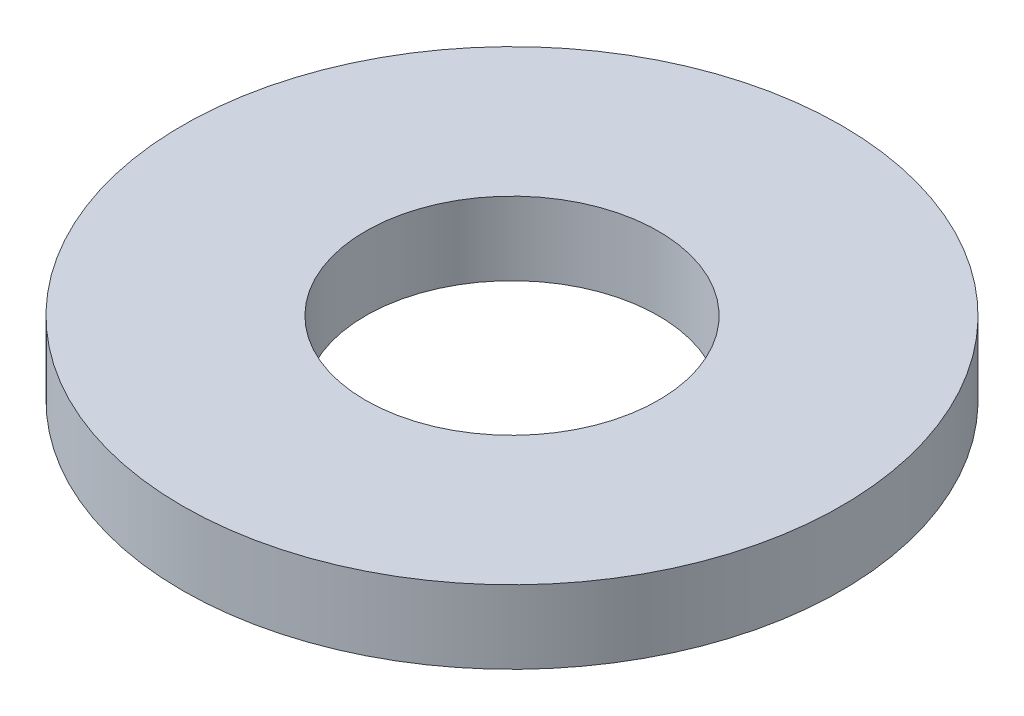
ISO-10303-21;
HEADER;
FILE_DESCRIPTION(('STEP AP214'),'2;1');
FILE_NAME('part.step','',(''),(''),'','','');
FILE_SCHEMA(('AUTOMOTIVE_DESIGN { 1 0 10303 214 1 1 1 1 }'));
ENDSEC;
DATA;
#1=APPLICATION_CONTEXT('core data for automotive mechanical design processes');
#2=APPLICATION_PROTOCOL_DEFINITION('international standard','automotive_design',2000,#1);
#3=PRODUCT_CONTEXT('',#1,'mechanical');
#4=PRODUCT('Part','Part','',(#3));
#5=PRODUCT_RELATED_PRODUCT_CATEGORY('part','',(#4));
#6=PRODUCT_DEFINITION_FORMATION('','',#4);
#7=PRODUCT_DEFINITION_CONTEXT('part definition',#1,'design');
#8=PRODUCT_DEFINITION('design','',#6,#7);
#9=PRODUCT_DEFINITION_SHAPE('','',#8);
#10=(LENGTH_UNIT() NAMED_UNIT(*) SI_UNIT(.MILLI.,.METRE.));
#11=(NAMED_UNIT(*) PLANE_ANGLE_UNIT() SI_UNIT($,.RADIAN.));
#12=(NAMED_UNIT(*) SI_UNIT($,.STERADIAN.) SOLID_ANGLE_UNIT());
#13=UNCERTAINTY_MEASURE_WITH_UNIT(LENGTH_MEASURE(1.E-05),#10,'distance_accuracy_value','');
#14=(GEOMETRIC_REPRESENTATION_CONTEXT(3) GLOBAL_UNCERTAINTY_ASSIGNED_CONTEXT((#13)) GLOBAL_UNIT_ASSIGNED_CONTEXT((#10,
#11,#12)) REPRESENTATION_CONTEXT('',''));
#15=CARTESIAN_POINT('',(0.,0.,0.));
#16=DIRECTION('',(0.,0.,1.));
#17=DIRECTION('',(1.,0.,0.));
#18=AXIS2_PLACEMENT_3D('',#15,#16,#17);
#19=CARTESIAN_POINT('',(0.,15.,0.));
#20=DIRECTION('',(0.,-1.,0.));
#21=DIRECTION('',(0.,0.,-1.));
#22=AXIS2_PLACEMENT_3D('',#19,#20,#21);
#23=CYLINDRICAL_SURFACE('',#22,67.5);
#24=CARTESIAN_POINT('',(0.,15.,0.));
#25=DIRECTION('',(0.,1.,0.));
#26=DIRECTION('',(0.,0.,1.));
#27=AXIS2_PLACEMENT_3D('',#24,#25,#26);
#28=CIRCLE('',#27,67.5);
#29=CARTESIAN_POINT('',(0.,15.,67.5));
#30=VERTEX_POINT('',#29);
#31=EDGE_CURVE('E10',#30,#30,#28,.T.);
#32=ORIENTED_EDGE('',*,*,#31,.F.);
#33=EDGE_LOOP('',(#32));
#34=FACE_BOUND('',#33,.T.);
#35=CARTESIAN_POINT('',(0.,0.,0.));
#36=DIRECTION('',(0.,1.,0.));
#37=DIRECTION('',(0.,0.,1.));
#38=AXIS2_PLACEMENT_3D('',#35,#36,#37);
#39=CIRCLE('',#38,67.5);
#40=CARTESIAN_POINT('',(0.,0.,67.5));
#41=VERTEX_POINT('',#40);
#42=EDGE_CURVE('E37',#41,#41,#39,.T.);
#43=ORIENTED_EDGE('',*,*,#42,.T.);
#44=EDGE_LOOP('',(#43));
#45=FACE_BOUND('',#44,.T.);
#46=ADVANCED_FACE('F40',(#34,#45),#23,.T.);
#47=CARTESIAN_POINT('',(0.,15.,0.));
#48=DIRECTION('',(0.,1.,0.));
#49=DIRECTION('',(0.,0.,1.));
#50=AXIS2_PLACEMENT_3D('',#47,#48,#49);
#51=PLANE('',#50);
#52=CARTESIAN_POINT('',(0.,15.,0.));
#53=DIRECTION('',(0.,1.,0.));
#54=DIRECTION('',(0.,0.,1.));
#55=AXIS2_PLACEMENT_3D('',#52,#53,#54);
#56=CIRCLE('',#55,30.);
#57=CARTESIAN_POINT('',(0.,15.,30.));
#58=VERTEX_POINT('',#57);
#59=EDGE_CURVE('E50',#58,#58,#56,.T.);
#60=ORIENTED_EDGE('',*,*,#59,.F.);
#61=EDGE_LOOP('',(#60));
#62=FACE_BOUND('',#61,.T.);
#63=ORIENTED_EDGE('',*,*,#31,.T.);
#64=EDGE_LOOP('',(#63));
#65=FACE_BOUND('',#64,.T.);
#66=ADVANCED_FACE('F59',(#62,#65),#51,.T.);
#67=CARTESIAN_POINT('',(0.,0.,0.));
#68=DIRECTION('',(0.,1.,0.));
#69=DIRECTION('',(0.,0.,1.));
#70=AXIS2_PLACEMENT_3D('',#67,#68,#69);
#71=PLANE('',#70);
#72=CARTESIAN_POINT('',(0.,0.,0.));
#73=DIRECTION('',(0.,1.,0.));
#74=DIRECTION('',(0.,0.,1.));
#75=AXIS2_PLACEMENT_3D('',#72,#73,#74);
#76=CIRCLE('',#75,30.);
#77=CARTESIAN_POINT('',(0.,0.,30.));
#78=VERTEX_POINT('',#77);
#79=EDGE_CURVE('E47',#78,#78,#76,.T.);
#80=ORIENTED_EDGE('',*,*,#79,.T.);
#81=EDGE_LOOP('',(#80));
#82=FACE_BOUND('',#81,.T.);
#83=ORIENTED_EDGE('',*,*,#42,.F.);
#84=EDGE_LOOP('',(#83));
#85=FACE_BOUND('',#84,.T.);
#86=ADVANCED_FACE('F58',(#82,#85),#71,.F.);
#87=CARTESIAN_POINT('',(0.,15.,0.));
#88=DIRECTION('',(0.,-1.,0.));
#89=DIRECTION('',(0.,0.,-1.));
#90=AXIS2_PLACEMENT_3D('',#87,#88,#89);
#91=CYLINDRICAL_SURFACE('',#90,30.);
#92=ORIENTED_EDGE('',*,*,#59,.T.);
#93=EDGE_LOOP('',(#92));
#94=FACE_BOUND('',#93,.T.);
#95=ORIENTED_EDGE('',*,*,#79,.F.);
#96=EDGE_LOOP('',(#95));
#97=FACE_BOUND('',#96,.T.);
#98=ADVANCED_FACE('F54',(#94,#97),#91,.F.);
#99=CLOSED_SHELL('',(#46,#66,#86,#98));
#100=MANIFOLD_SOLID_BREP('B2',#99);
#101=ADVANCED_BREP_SHAPE_REPRESENTATION('',(#18,#100),#14);
#102=SHAPE_DEFINITION_REPRESENTATION(#9,#101);
ENDSEC;
END-ISO-10303-21;
